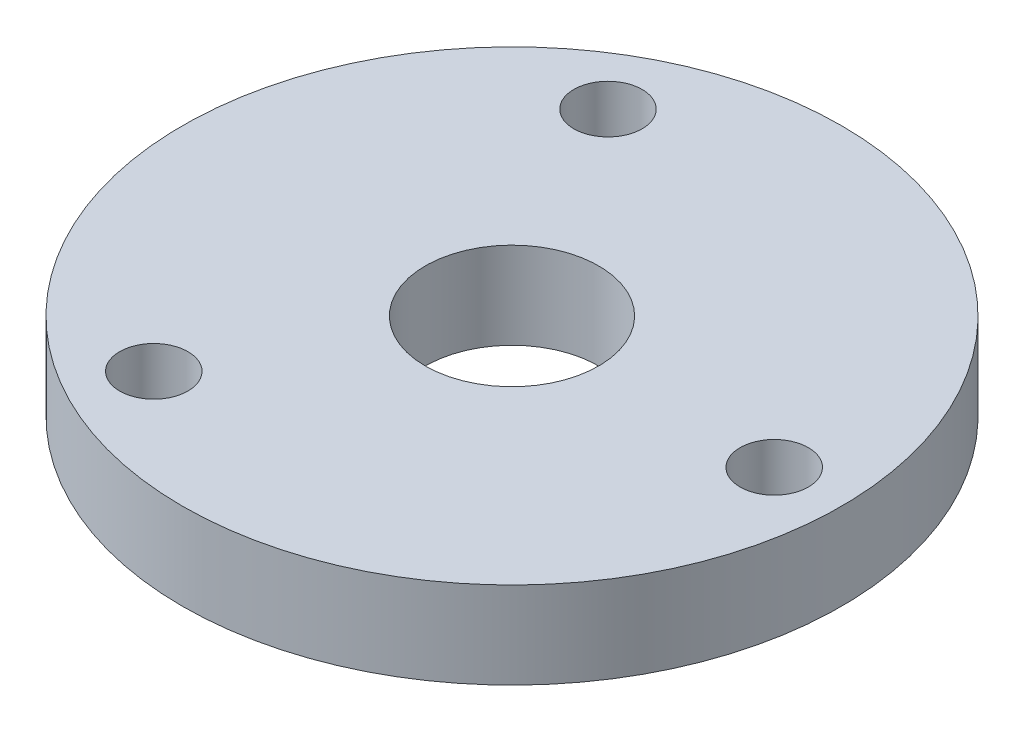
ISO-10303-21;
HEADER;
FILE_DESCRIPTION(('STEP AP214'),'2;1');
FILE_NAME('part.step','',(''),(''),'','','');
FILE_SCHEMA(('AUTOMOTIVE_DESIGN { 1 0 10303 214 1 1 1 1 }'));
ENDSEC;
DATA;
#1=APPLICATION_CONTEXT('core data for automotive mechanical design processes');
#2=APPLICATION_PROTOCOL_DEFINITION('international standard','automotive_design',2000,#1);
#3=PRODUCT_CONTEXT('',#1,'mechanical');
#4=PRODUCT('Part','Part','',(#3));
#5=PRODUCT_RELATED_PRODUCT_CATEGORY('part','',(#4));
#6=PRODUCT_DEFINITION_FORMATION('','',#4);
#7=PRODUCT_DEFINITION_CONTEXT('part definition',#1,'design');
#8=PRODUCT_DEFINITION('design','',#6,#7);
#9=PRODUCT_DEFINITION_SHAPE('','',#8);
#10=(LENGTH_UNIT() NAMED_UNIT(*) SI_UNIT(.MILLI.,.METRE.));
#11=(NAMED_UNIT(*) PLANE_ANGLE_UNIT() SI_UNIT($,.RADIAN.));
#12=(NAMED_UNIT(*) SI_UNIT($,.STERADIAN.) SOLID_ANGLE_UNIT());
#13=UNCERTAINTY_MEASURE_WITH_UNIT(LENGTH_MEASURE(1.E-05),#10,'distance_accuracy_value','');
#14=(GEOMETRIC_REPRESENTATION_CONTEXT(3) GLOBAL_UNCERTAINTY_ASSIGNED_CONTEXT((#13)) GLOBAL_UNIT_ASSIGNED_CONTEXT((#10,
#11,#12)) REPRESENTATION_CONTEXT('',''));
#15=CARTESIAN_POINT('',(0.,0.,0.));
#16=DIRECTION('',(0.,0.,1.));
#17=DIRECTION('',(1.,0.,0.));
#18=AXIS2_PLACEMENT_3D('',#15,#16,#17);
#19=CARTESIAN_POINT('',(0.,6.35,0.));
#20=DIRECTION('',(0.,1.,0.));
#21=DIRECTION('',(0.,0.,1.));
#22=AXIS2_PLACEMENT_3D('',#19,#20,#21);
#23=PLANE('',#22);
#24=CARTESIAN_POINT('',(-9.59999999999985,6.35,16.6276877526613));
#25=DIRECTION('',(0.,1.,0.));
#26=DIRECTION('',(0.,0.,1.));
#27=AXIS2_PLACEMENT_3D('',#24,#25,#26);
#28=CIRCLE('',#27,2.5);
#29=CARTESIAN_POINT('',(-9.59999999999985,6.35,19.1276877526613));
#30=VERTEX_POINT('',#29);
#31=EDGE_CURVE('E52',#30,#30,#28,.T.);
#32=ORIENTED_EDGE('',*,*,#31,.F.);
#33=EDGE_LOOP('',(#32));
#34=FACE_BOUND('',#33,.T.);
#35=CARTESIAN_POINT('',(19.2,6.35,0.));
#36=DIRECTION('',(0.,1.,0.));
#37=DIRECTION('',(0.,0.,1.));
#38=AXIS2_PLACEMENT_3D('',#35,#36,#37);
#39=CIRCLE('',#38,2.5);
#40=CARTESIAN_POINT('',(19.2,6.35,2.5));
#41=VERTEX_POINT('',#40);
#42=EDGE_CURVE('E41',#41,#41,#39,.T.);
#43=ORIENTED_EDGE('',*,*,#42,.F.);
#44=EDGE_LOOP('',(#43));
#45=FACE_BOUND('',#44,.T.);
#46=CARTESIAN_POINT('',(0.,6.35,0.));
#47=DIRECTION('',(0.,1.,0.));
#48=DIRECTION('',(0.,0.,1.));
#49=AXIS2_PLACEMENT_3D('',#46,#47,#48);
#50=CIRCLE('',#49,24.13);
#51=CARTESIAN_POINT('',(0.,6.35,24.13));
#52=VERTEX_POINT('',#51);
#53=EDGE_CURVE('E10',#52,#52,#50,.T.);
#54=ORIENTED_EDGE('',*,*,#53,.T.);
#55=EDGE_LOOP('',(#54));
#56=FACE_BOUND('',#55,.T.);
#57=CARTESIAN_POINT('',(-9.60000000000008,6.35,-16.6276877526612));
#58=DIRECTION('',(0.,1.,0.));
#59=DIRECTION('',(0.,0.,1.));
#60=AXIS2_PLACEMENT_3D('',#57,#58,#59);
#61=CIRCLE('',#60,2.5);
#62=CARTESIAN_POINT('',(-9.60000000000008,6.35,-14.1276877526612));
#63=VERTEX_POINT('',#62);
#64=EDGE_CURVE('E46',#63,#63,#61,.T.);
#65=ORIENTED_EDGE('',*,*,#64,.F.);
#66=EDGE_LOOP('',(#65));
#67=FACE_BOUND('',#66,.T.);
#68=CARTESIAN_POINT('',(0.,6.35,0.));
#69=DIRECTION('',(0.,1.,0.));
#70=DIRECTION('',(0.,0.,1.));
#71=AXIS2_PLACEMENT_3D('',#68,#69,#70);
#72=CIRCLE('',#71,6.35);
#73=CARTESIAN_POINT('',(0.,6.35,6.35));
#74=VERTEX_POINT('',#73);
#75=EDGE_CURVE('E58',#74,#74,#72,.T.);
#76=ORIENTED_EDGE('',*,*,#75,.F.);
#77=EDGE_LOOP('',(#76));
#78=FACE_BOUND('',#77,.T.);
#79=ADVANCED_FACE('F30',(#34,#45,#56,#67,#78),#23,.T.);
#80=CARTESIAN_POINT('',(0.,0.,0.));
#81=DIRECTION('',(0.,1.,0.));
#82=DIRECTION('',(0.,0.,1.));
#83=AXIS2_PLACEMENT_3D('',#80,#81,#82);
#84=PLANE('',#83);
#85=CARTESIAN_POINT('',(0.,0.,0.));
#86=DIRECTION('',(0.,1.,0.));
#87=DIRECTION('',(0.,0.,1.));
#88=AXIS2_PLACEMENT_3D('',#85,#86,#87);
#89=CIRCLE('',#88,24.13);
#90=CARTESIAN_POINT('',(0.,0.,24.13));
#91=VERTEX_POINT('',#90);
#92=EDGE_CURVE('E34',#91,#91,#89,.T.);
#93=ORIENTED_EDGE('',*,*,#92,.F.);
#94=EDGE_LOOP('',(#93));
#95=FACE_BOUND('',#94,.T.);
#96=CARTESIAN_POINT('',(19.2,0.,0.));
#97=DIRECTION('',(0.,1.,0.));
#98=DIRECTION('',(0.,0.,1.));
#99=AXIS2_PLACEMENT_3D('',#96,#97,#98);
#100=CIRCLE('',#99,2.5);
#101=CARTESIAN_POINT('',(19.2,0.,2.5));
#102=VERTEX_POINT('',#101);
#103=EDGE_CURVE('E43',#102,#102,#100,.T.);
#104=ORIENTED_EDGE('',*,*,#103,.T.);
#105=EDGE_LOOP('',(#104));
#106=FACE_BOUND('',#105,.T.);
#107=CARTESIAN_POINT('',(-9.60000000000008,0.,-16.6276877526612));
#108=DIRECTION('',(0.,1.,0.));
#109=DIRECTION('',(0.,0.,1.));
#110=AXIS2_PLACEMENT_3D('',#107,#108,#109);
#111=CIRCLE('',#110,2.5);
#112=CARTESIAN_POINT('',(-9.60000000000008,0.,-14.1276877526612));
#113=VERTEX_POINT('',#112);
#114=EDGE_CURVE('E49',#113,#113,#111,.T.);
#115=ORIENTED_EDGE('',*,*,#114,.T.);
#116=EDGE_LOOP('',(#115));
#117=FACE_BOUND('',#116,.T.);
#118=CARTESIAN_POINT('',(-9.59999999999985,0.,16.6276877526613));
#119=DIRECTION('',(0.,1.,0.));
#120=DIRECTION('',(0.,0.,1.));
#121=AXIS2_PLACEMENT_3D('',#118,#119,#120);
#122=CIRCLE('',#121,2.5);
#123=CARTESIAN_POINT('',(-9.59999999999985,0.,19.1276877526613));
#124=VERTEX_POINT('',#123);
#125=EDGE_CURVE('E55',#124,#124,#122,.T.);
#126=ORIENTED_EDGE('',*,*,#125,.T.);
#127=EDGE_LOOP('',(#126));
#128=FACE_BOUND('',#127,.T.);
#129=CARTESIAN_POINT('',(0.,0.,0.));
#130=DIRECTION('',(0.,1.,0.));
#131=DIRECTION('',(0.,0.,1.));
#132=AXIS2_PLACEMENT_3D('',#129,#130,#131);
#133=CIRCLE('',#132,6.35);
#134=CARTESIAN_POINT('',(0.,0.,6.35));
#135=VERTEX_POINT('',#134);
#136=EDGE_CURVE('E61',#135,#135,#133,.T.);
#137=ORIENTED_EDGE('',*,*,#136,.T.);
#138=EDGE_LOOP('',(#137));
#139=FACE_BOUND('',#138,.T.);
#140=ADVANCED_FACE('F71',(#95,#106,#117,#128,#139),#84,.F.);
#141=CARTESIAN_POINT('',(0.,6.35,0.));
#142=DIRECTION('',(0.,-1.,0.));
#143=DIRECTION('',(0.,0.,-1.));
#144=AXIS2_PLACEMENT_3D('',#141,#142,#143);
#145=CYLINDRICAL_SURFACE('',#144,24.13);
#146=ORIENTED_EDGE('',*,*,#53,.F.);
#147=EDGE_LOOP('',(#146));
#148=FACE_BOUND('',#147,.T.);
#149=ORIENTED_EDGE('',*,*,#92,.T.);
#150=EDGE_LOOP('',(#149));
#151=FACE_BOUND('',#150,.T.);
#152=ADVANCED_FACE('F32',(#148,#151),#145,.T.);
#153=CARTESIAN_POINT('',(19.2,6.35,0.));
#154=DIRECTION('',(0.,-1.,0.));
#155=DIRECTION('',(0.,0.,-1.));
#156=AXIS2_PLACEMENT_3D('',#153,#154,#155);
#157=CYLINDRICAL_SURFACE('',#156,2.5);
#158=ORIENTED_EDGE('',*,*,#42,.T.);
#159=EDGE_LOOP('',(#158));
#160=FACE_BOUND('',#159,.T.);
#161=ORIENTED_EDGE('',*,*,#103,.F.);
#162=EDGE_LOOP('',(#161));
#163=FACE_BOUND('',#162,.T.);
#164=ADVANCED_FACE('F81',(#160,#163),#157,.F.);
#165=CARTESIAN_POINT('',(-9.60000000000008,6.35,-16.6276877526612));
#166=DIRECTION('',(0.,-1.,0.));
#167=DIRECTION('',(0.,0.,-1.));
#168=AXIS2_PLACEMENT_3D('',#165,#166,#167);
#169=CYLINDRICAL_SURFACE('',#168,2.5);
#170=ORIENTED_EDGE('',*,*,#64,.T.);
#171=EDGE_LOOP('',(#170));
#172=FACE_BOUND('',#171,.T.);
#173=ORIENTED_EDGE('',*,*,#114,.F.);
#174=EDGE_LOOP('',(#173));
#175=FACE_BOUND('',#174,.T.);
#176=ADVANCED_FACE('F84',(#172,#175),#169,.F.);
#177=CARTESIAN_POINT('',(-9.59999999999985,6.35,16.6276877526613));
#178=DIRECTION('',(0.,-1.,0.));
#179=DIRECTION('',(0.,0.,-1.));
#180=AXIS2_PLACEMENT_3D('',#177,#178,#179);
#181=CYLINDRICAL_SURFACE('',#180,2.5);
#182=ORIENTED_EDGE('',*,*,#31,.T.);
#183=EDGE_LOOP('',(#182));
#184=FACE_BOUND('',#183,.T.);
#185=ORIENTED_EDGE('',*,*,#125,.F.);
#186=EDGE_LOOP('',(#185));
#187=FACE_BOUND('',#186,.T.);
#188=ADVANCED_FACE('F88',(#184,#187),#181,.F.);
#189=CARTESIAN_POINT('',(0.,6.35,0.));
#190=DIRECTION('',(0.,-1.,0.));
#191=DIRECTION('',(0.,0.,-1.));
#192=AXIS2_PLACEMENT_3D('',#189,#190,#191);
#193=CYLINDRICAL_SURFACE('',#192,6.35);
#194=ORIENTED_EDGE('',*,*,#75,.T.);
#195=EDGE_LOOP('',(#194));
#196=FACE_BOUND('',#195,.T.);
#197=ORIENTED_EDGE('',*,*,#136,.F.);
#198=EDGE_LOOP('',(#197));
#199=FACE_BOUND('',#198,.T.);
#200=ADVANCED_FACE('F67',(#196,#199),#193,.F.);
#201=CLOSED_SHELL('',(#79,#140,#152,#164,#176,#188,#200));
#202=MANIFOLD_SOLID_BREP('B2',#201);
#203=ADVANCED_BREP_SHAPE_REPRESENTATION('',(#18,#202),#14);
#204=SHAPE_DEFINITION_REPRESENTATION(#9,#203);
ENDSEC;
END-ISO-10303-21;
